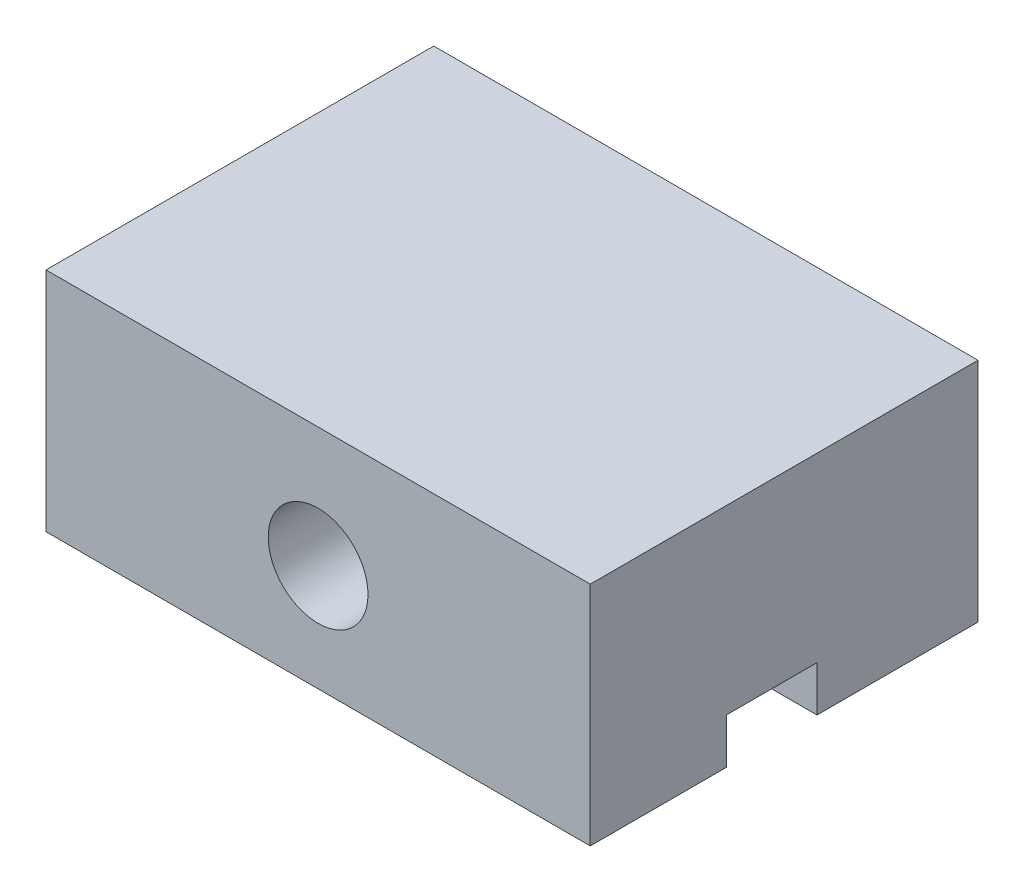
ISO-10303-21;
HEADER;
FILE_DESCRIPTION(('STEP AP214'),'2;1');
FILE_NAME('part.step','',(''),(''),'','','');
FILE_SCHEMA(('AUTOMOTIVE_DESIGN { 1 0 10303 214 1 1 1 1 }'));
ENDSEC;
DATA;
#1=APPLICATION_CONTEXT('core data for automotive mechanical design processes');
#2=APPLICATION_PROTOCOL_DEFINITION('international standard','automotive_design',2000,#1);
#3=PRODUCT_CONTEXT('',#1,'mechanical');
#4=PRODUCT('Part','Part','',(#3));
#5=PRODUCT_RELATED_PRODUCT_CATEGORY('part','',(#4));
#6=PRODUCT_DEFINITION_FORMATION('','',#4);
#7=PRODUCT_DEFINITION_CONTEXT('part definition',#1,'design');
#8=PRODUCT_DEFINITION('design','',#6,#7);
#9=PRODUCT_DEFINITION_SHAPE('','',#8);
#10=(LENGTH_UNIT() NAMED_UNIT(*) SI_UNIT(.MILLI.,.METRE.));
#11=(NAMED_UNIT(*) PLANE_ANGLE_UNIT() SI_UNIT($,.RADIAN.));
#12=(NAMED_UNIT(*) SI_UNIT($,.STERADIAN.) SOLID_ANGLE_UNIT());
#13=UNCERTAINTY_MEASURE_WITH_UNIT(LENGTH_MEASURE(1.E-05),#10,'distance_accuracy_value','');
#14=(GEOMETRIC_REPRESENTATION_CONTEXT(3) GLOBAL_UNCERTAINTY_ASSIGNED_CONTEXT((#13)) GLOBAL_UNIT_ASSIGNED_CONTEXT((#10,
#11,#12)) REPRESENTATION_CONTEXT('',''));
#15=CARTESIAN_POINT('',(0.,0.,0.));
#16=DIRECTION('',(0.,0.,1.));
#17=DIRECTION('',(1.,0.,0.));
#18=AXIS2_PLACEMENT_3D('',#15,#16,#17);
#19=CARTESIAN_POINT('',(-6.,-2.5,8.55));
#20=DIRECTION('',(0.,1.,0.));
#21=DIRECTION('',(0.,0.,1.));
#22=AXIS2_PLACEMENT_3D('',#19,#20,#21);
#23=PLANE('',#22);
#24=DIRECTION('',(0.,0.,-1.));
#25=VECTOR('',#24,1.);
#26=CARTESIAN_POINT('',(6.,-2.5,8.55));
#27=LINE('',#26,#25);
#28=CARTESIAN_POINT('',(6.,-2.5,3.55));
#29=VERTEX_POINT('',#28);
#30=CARTESIAN_POINT('',(6.,-2.5,0.));
#31=VERTEX_POINT('',#30);
#32=EDGE_CURVE('E85',#29,#31,#27,.T.);
#33=ORIENTED_EDGE('',*,*,#32,.F.);
#34=DIRECTION('',(1.,0.,0.));
#35=VECTOR('',#34,1.);
#36=CARTESIAN_POINT('',(-6.,-2.5,3.55));
#37=LINE('',#36,#35);
#38=CARTESIAN_POINT('',(-6.,-2.5,3.55));
#39=VERTEX_POINT('',#38);
#40=EDGE_CURVE('E127',#39,#29,#37,.T.);
#41=ORIENTED_EDGE('',*,*,#40,.F.);
#42=DIRECTION('',(0.,0.,-1.));
#43=VECTOR('',#42,1.);
#44=CARTESIAN_POINT('',(-6.,-2.5,8.55));
#45=LINE('',#44,#43);
#46=CARTESIAN_POINT('',(-6.,-2.5,0.));
#47=VERTEX_POINT('',#46);
#48=EDGE_CURVE('E161',#39,#47,#45,.T.);
#49=ORIENTED_EDGE('',*,*,#48,.T.);
#50=DIRECTION('',(1.,0.,0.));
#51=VECTOR('',#50,1.);
#52=CARTESIAN_POINT('',(-6.,-2.5,0.));
#53=LINE('',#52,#51);
#54=EDGE_CURVE('E148',#47,#31,#53,.T.);
#55=ORIENTED_EDGE('',*,*,#54,.T.);
#56=EDGE_LOOP('',(#33,#41,#49,#55));
#57=FACE_BOUND('',#56,.T.);
#58=ADVANCED_FACE('F39',(#57),#23,.F.);
#59=CARTESIAN_POINT('',(6.,-2.5,8.55));
#60=DIRECTION('',(-1.,0.,0.));
#61=DIRECTION('',(0.,0.,1.));
#62=AXIS2_PLACEMENT_3D('',#59,#60,#61);
#63=PLANE('',#62);
#64=DIRECTION('',(0.,0.,1.));
#65=VECTOR('',#64,1.);
#66=CARTESIAN_POINT('',(6.,-1.5,3.55));
#67=LINE('',#66,#65);
#68=CARTESIAN_POINT('',(6.,-1.5,3.55));
#69=VERTEX_POINT('',#68);
#70=CARTESIAN_POINT('',(6.,-1.5,5.55));
#71=VERTEX_POINT('',#70);
#72=EDGE_CURVE('E120',#69,#71,#67,.T.);
#73=ORIENTED_EDGE('',*,*,#72,.F.);
#74=DIRECTION('',(0.,-1.,0.));
#75=VECTOR('',#74,1.);
#76=CARTESIAN_POINT('',(6.,-1.5,3.55));
#77=LINE('',#76,#75);
#78=EDGE_CURVE('E145',#69,#29,#77,.T.);
#79=ORIENTED_EDGE('',*,*,#78,.T.);
#80=ORIENTED_EDGE('',*,*,#32,.T.);
#81=DIRECTION('',(0.,1.,0.));
#82=VECTOR('',#81,1.);
#83=CARTESIAN_POINT('',(6.,-2.5,0.));
#84=LINE('',#83,#82);
#85=CARTESIAN_POINT('',(6.,2.5,0.));
#86=VERTEX_POINT('',#85);
#87=EDGE_CURVE('E141',#31,#86,#84,.T.);
#88=ORIENTED_EDGE('',*,*,#87,.T.);
#89=DIRECTION('',(0.,0.,-1.));
#90=VECTOR('',#89,1.);
#91=CARTESIAN_POINT('',(6.,2.5,8.55));
#92=LINE('',#91,#90);
#93=CARTESIAN_POINT('',(6.,2.5,8.55));
#94=VERTEX_POINT('',#93);
#95=EDGE_CURVE('E11',#94,#86,#92,.T.);
#96=ORIENTED_EDGE('',*,*,#95,.F.);
#97=DIRECTION('',(0.,1.,0.));
#98=VECTOR('',#97,1.);
#99=CARTESIAN_POINT('',(6.,-2.5,8.55));
#100=LINE('',#99,#98);
#101=CARTESIAN_POINT('',(6.,-2.5,8.55));
#102=VERTEX_POINT('',#101);
#103=EDGE_CURVE('E146',#102,#94,#100,.T.);
#104=ORIENTED_EDGE('',*,*,#103,.F.);
#105=CARTESIAN_POINT('',(6.,-2.5,5.55));
#106=VERTEX_POINT('',#105);
#107=EDGE_CURVE('E131',#102,#106,#27,.T.);
#108=ORIENTED_EDGE('',*,*,#107,.T.);
#109=DIRECTION('',(0.,-1.,0.));
#110=VECTOR('',#109,1.);
#111=CARTESIAN_POINT('',(6.,-1.5,5.55));
#112=LINE('',#111,#110);
#113=EDGE_CURVE('E54',#71,#106,#112,.T.);
#114=ORIENTED_EDGE('',*,*,#113,.F.);
#115=EDGE_LOOP('',(#73,#79,#80,#88,#96,#104,#108,#114));
#116=FACE_BOUND('',#115,.T.);
#117=ADVANCED_FACE('F41',(#116),#63,.F.);
#118=CARTESIAN_POINT('',(-6.,2.5,8.55));
#119=DIRECTION('',(0.,-1.,0.));
#120=DIRECTION('',(0.,0.,-1.));
#121=AXIS2_PLACEMENT_3D('',#118,#119,#120);
#122=PLANE('',#121);
#123=DIRECTION('',(-1.,0.,0.));
#124=VECTOR('',#123,1.);
#125=CARTESIAN_POINT('',(-6.,2.5,0.));
#126=LINE('',#125,#124);
#127=CARTESIAN_POINT('',(-6.,2.5,0.));
#128=VERTEX_POINT('',#127);
#129=EDGE_CURVE('E154',#86,#128,#126,.T.);
#130=ORIENTED_EDGE('',*,*,#129,.T.);
#131=DIRECTION('',(0.,0.,-1.));
#132=VECTOR('',#131,1.);
#133=CARTESIAN_POINT('',(-6.,2.5,8.55));
#134=LINE('',#133,#132);
#135=CARTESIAN_POINT('',(-6.,2.5,8.55));
#136=VERTEX_POINT('',#135);
#137=EDGE_CURVE('E47',#136,#128,#134,.T.);
#138=ORIENTED_EDGE('',*,*,#137,.F.);
#139=DIRECTION('',(-1.,0.,0.));
#140=VECTOR('',#139,1.);
#141=CARTESIAN_POINT('',(-6.,2.5,8.55));
#142=LINE('',#141,#140);
#143=EDGE_CURVE('E92',#94,#136,#142,.T.);
#144=ORIENTED_EDGE('',*,*,#143,.F.);
#145=ORIENTED_EDGE('',*,*,#95,.T.);
#146=EDGE_LOOP('',(#130,#138,#144,#145));
#147=FACE_BOUND('',#146,.T.);
#148=ADVANCED_FACE('F204',(#147),#122,.F.);
#149=CARTESIAN_POINT('',(-6.,-2.5,8.55));
#150=DIRECTION('',(1.,0.,0.));
#151=DIRECTION('',(0.,0.,-1.));
#152=AXIS2_PLACEMENT_3D('',#149,#150,#151);
#153=PLANE('',#152);
#154=ORIENTED_EDGE('',*,*,#48,.F.);
#155=DIRECTION('',(0.,-1.,0.));
#156=VECTOR('',#155,1.);
#157=CARTESIAN_POINT('',(-6.,-1.5,3.55));
#158=LINE('',#157,#156);
#159=CARTESIAN_POINT('',(-6.,-1.5,3.55));
#160=VERTEX_POINT('',#159);
#161=EDGE_CURVE('E133',#160,#39,#158,.T.);
#162=ORIENTED_EDGE('',*,*,#161,.F.);
#163=DIRECTION('',(0.,0.,-1.));
#164=VECTOR('',#163,1.);
#165=CARTESIAN_POINT('',(-6.,-1.5,3.55));
#166=LINE('',#165,#164);
#167=CARTESIAN_POINT('',(-6.,-1.5,5.55));
#168=VERTEX_POINT('',#167);
#169=EDGE_CURVE('E119',#168,#160,#166,.T.);
#170=ORIENTED_EDGE('',*,*,#169,.F.);
#171=DIRECTION('',(0.,-1.,0.));
#172=VECTOR('',#171,1.);
#173=CARTESIAN_POINT('',(-6.,-1.5,5.55));
#174=LINE('',#173,#172);
#175=CARTESIAN_POINT('',(-6.,-2.5,5.55));
#176=VERTEX_POINT('',#175);
#177=EDGE_CURVE('E116',#168,#176,#174,.T.);
#178=ORIENTED_EDGE('',*,*,#177,.T.);
#179=CARTESIAN_POINT('',(-6.,-2.5,8.55));
#180=VERTEX_POINT('',#179);
#181=EDGE_CURVE('E162',#180,#176,#45,.T.);
#182=ORIENTED_EDGE('',*,*,#181,.F.);
#183=DIRECTION('',(0.,-1.,0.));
#184=VECTOR('',#183,1.);
#185=CARTESIAN_POINT('',(-6.,-2.5,8.55));
#186=LINE('',#185,#184);
#187=EDGE_CURVE('E150',#136,#180,#186,.T.);
#188=ORIENTED_EDGE('',*,*,#187,.F.);
#189=ORIENTED_EDGE('',*,*,#137,.T.);
#190=DIRECTION('',(0.,-1.,0.));
#191=VECTOR('',#190,1.);
#192=CARTESIAN_POINT('',(-6.,-2.5,0.));
#193=LINE('',#192,#191);
#194=EDGE_CURVE('E156',#128,#47,#193,.T.);
#195=ORIENTED_EDGE('',*,*,#194,.T.);
#196=EDGE_LOOP('',(#154,#162,#170,#178,#182,#188,#189,#195));
#197=FACE_BOUND('',#196,.T.);
#198=ADVANCED_FACE('F169',(#197),#153,.F.);
#199=ORIENTED_EDGE('',*,*,#181,.T.);
#200=DIRECTION('',(-1.,0.,0.));
#201=VECTOR('',#200,1.);
#202=CARTESIAN_POINT('',(-6.,-2.5,5.55));
#203=LINE('',#202,#201);
#204=EDGE_CURVE('E182',#106,#176,#203,.T.);
#205=ORIENTED_EDGE('',*,*,#204,.F.);
#206=ORIENTED_EDGE('',*,*,#107,.F.);
#207=DIRECTION('',(1.,0.,0.));
#208=VECTOR('',#207,1.);
#209=CARTESIAN_POINT('',(-6.,-2.5,8.55));
#210=LINE('',#209,#208);
#211=EDGE_CURVE('E63',#180,#102,#210,.T.);
#212=ORIENTED_EDGE('',*,*,#211,.F.);
#213=EDGE_LOOP('',(#199,#205,#206,#212));
#214=FACE_BOUND('',#213,.T.);
#215=ADVANCED_FACE('F199',(#214),#23,.F.);
#216=CARTESIAN_POINT('',(0.,0.,8.55));
#217=DIRECTION('',(0.,0.,-1.));
#218=DIRECTION('',(-1.,0.,0.));
#219=AXIS2_PLACEMENT_3D('',#216,#217,#218);
#220=PLANE('',#219);
#221=CARTESIAN_POINT('',(0.,-0.15,8.55));
#222=DIRECTION('',(0.,0.,1.));
#223=DIRECTION('',(1.,0.,0.));
#224=AXIS2_PLACEMENT_3D('',#221,#222,#223);
#225=CIRCLE('',#224,1.1);
#226=CARTESIAN_POINT('',(1.1,-0.15,8.55));
#227=VERTEX_POINT('',#226);
#228=EDGE_CURVE('E142',#227,#227,#225,.T.);
#229=ORIENTED_EDGE('',*,*,#228,.F.);
#230=EDGE_LOOP('',(#229));
#231=FACE_BOUND('',#230,.T.);
#232=ORIENTED_EDGE('',*,*,#103,.T.);
#233=ORIENTED_EDGE('',*,*,#143,.T.);
#234=ORIENTED_EDGE('',*,*,#187,.T.);
#235=ORIENTED_EDGE('',*,*,#211,.T.);
#236=EDGE_LOOP('',(#232,#233,#234,#235));
#237=FACE_BOUND('',#236,.T.);
#238=ADVANCED_FACE('F208',(#231,#237),#220,.F.);
#239=CARTESIAN_POINT('',(0.,0.,0.));
#240=DIRECTION('',(0.,0.,-1.));
#241=DIRECTION('',(-1.,0.,0.));
#242=AXIS2_PLACEMENT_3D('',#239,#240,#241);
#243=PLANE('',#242);
#244=CARTESIAN_POINT('',(0.,-0.15,0.));
#245=DIRECTION('',(0.,0.,1.));
#246=DIRECTION('',(1.,0.,0.));
#247=AXIS2_PLACEMENT_3D('',#244,#245,#246);
#248=CIRCLE('',#247,1.1);
#249=CARTESIAN_POINT('',(1.1,-0.15,0.));
#250=VERTEX_POINT('',#249);
#251=EDGE_CURVE('E138',#250,#250,#248,.T.);
#252=ORIENTED_EDGE('',*,*,#251,.T.);
#253=EDGE_LOOP('',(#252));
#254=FACE_BOUND('',#253,.T.);
#255=ORIENTED_EDGE('',*,*,#87,.F.);
#256=ORIENTED_EDGE('',*,*,#54,.F.);
#257=ORIENTED_EDGE('',*,*,#194,.F.);
#258=ORIENTED_EDGE('',*,*,#129,.F.);
#259=EDGE_LOOP('',(#255,#256,#257,#258));
#260=FACE_BOUND('',#259,.T.);
#261=ADVANCED_FACE('F174',(#254,#260),#243,.T.);
#262=CARTESIAN_POINT('',(0.,-0.15,0.));
#263=DIRECTION('',(0.,0.,1.));
#264=DIRECTION('',(1.,0.,0.));
#265=AXIS2_PLACEMENT_3D('',#262,#263,#264);
#266=CYLINDRICAL_SURFACE('',#265,1.1);
#267=ORIENTED_EDGE('',*,*,#251,.F.);
#268=EDGE_LOOP('',(#267));
#269=FACE_BOUND('',#268,.T.);
#270=ORIENTED_EDGE('',*,*,#228,.T.);
#271=EDGE_LOOP('',(#270));
#272=FACE_BOUND('',#271,.T.);
#273=ADVANCED_FACE('F186',(#269,#272),#266,.F.);
#274=CARTESIAN_POINT('',(-6.,-1.5,3.55));
#275=DIRECTION('',(0.,0.,-1.));
#276=DIRECTION('',(-1.,0.,0.));
#277=AXIS2_PLACEMENT_3D('',#274,#275,#276);
#278=PLANE('',#277);
#279=ORIENTED_EDGE('',*,*,#40,.T.);
#280=ORIENTED_EDGE('',*,*,#78,.F.);
#281=DIRECTION('',(1.,0.,0.));
#282=VECTOR('',#281,1.);
#283=CARTESIAN_POINT('',(-6.,-1.5,3.55));
#284=LINE('',#283,#282);
#285=EDGE_CURVE('E126',#160,#69,#284,.T.);
#286=ORIENTED_EDGE('',*,*,#285,.F.);
#287=ORIENTED_EDGE('',*,*,#161,.T.);
#288=EDGE_LOOP('',(#279,#280,#286,#287));
#289=FACE_BOUND('',#288,.T.);
#290=ADVANCED_FACE('F184',(#289),#278,.F.);
#291=CARTESIAN_POINT('',(-6.,-1.5,5.55));
#292=DIRECTION('',(0.,0.,1.));
#293=DIRECTION('',(1.,0.,0.));
#294=AXIS2_PLACEMENT_3D('',#291,#292,#293);
#295=PLANE('',#294);
#296=ORIENTED_EDGE('',*,*,#204,.T.);
#297=ORIENTED_EDGE('',*,*,#177,.F.);
#298=DIRECTION('',(-1.,0.,0.));
#299=VECTOR('',#298,1.);
#300=CARTESIAN_POINT('',(-6.,-1.5,5.55));
#301=LINE('',#300,#299);
#302=EDGE_CURVE('E112',#71,#168,#301,.T.);
#303=ORIENTED_EDGE('',*,*,#302,.F.);
#304=ORIENTED_EDGE('',*,*,#113,.T.);
#305=EDGE_LOOP('',(#296,#297,#303,#304));
#306=FACE_BOUND('',#305,.T.);
#307=ADVANCED_FACE('F114',(#306),#295,.F.);
#308=CARTESIAN_POINT('',(0.,-1.5,0.));
#309=DIRECTION('',(0.,1.,0.));
#310=DIRECTION('',(0.,0.,1.));
#311=AXIS2_PLACEMENT_3D('',#308,#309,#310);
#312=PLANE('',#311);
#313=ORIENTED_EDGE('',*,*,#72,.T.);
#314=ORIENTED_EDGE('',*,*,#302,.T.);
#315=ORIENTED_EDGE('',*,*,#169,.T.);
#316=ORIENTED_EDGE('',*,*,#285,.T.);
#317=EDGE_LOOP('',(#313,#314,#315,#316));
#318=FACE_BOUND('',#317,.T.);
#319=ADVANCED_FACE('F124',(#318),#312,.F.);
#320=CLOSED_SHELL('',(#58,#117,#148,#198,#215,#238,#261,#273,#290,#307,#319));
#321=MANIFOLD_SOLID_BREP('B2',#320);
#322=ADVANCED_BREP_SHAPE_REPRESENTATION('',(#18,#321),#14);
#323=SHAPE_DEFINITION_REPRESENTATION(#9,#322);
ENDSEC;
END-ISO-10303-21;
